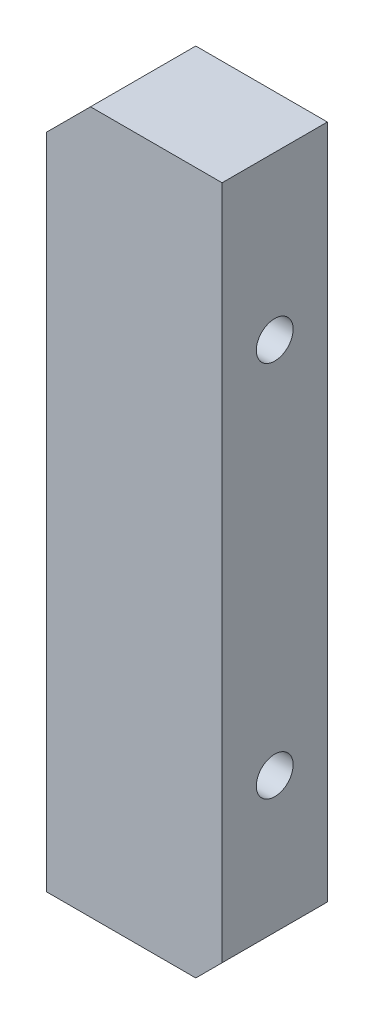
ISO-10303-21;
HEADER;
FILE_DESCRIPTION(('STEP AP214'),'2;1');
FILE_NAME('part.step','',(''),(''),'','','');
FILE_SCHEMA(('AUTOMOTIVE_DESIGN { 1 0 10303 214 1 1 1 1 }'));
ENDSEC;
DATA;
#1=APPLICATION_CONTEXT('core data for automotive mechanical design processes');
#2=APPLICATION_PROTOCOL_DEFINITION('international standard','automotive_design',2000,#1);
#3=PRODUCT_CONTEXT('',#1,'mechanical');
#4=PRODUCT('Part','Part','',(#3));
#5=PRODUCT_RELATED_PRODUCT_CATEGORY('part','',(#4));
#6=PRODUCT_DEFINITION_FORMATION('','',#4);
#7=PRODUCT_DEFINITION_CONTEXT('part definition',#1,'design');
#8=PRODUCT_DEFINITION('design','',#6,#7);
#9=PRODUCT_DEFINITION_SHAPE('','',#8);
#10=(LENGTH_UNIT() NAMED_UNIT(*) SI_UNIT(.MILLI.,.METRE.));
#11=(NAMED_UNIT(*) PLANE_ANGLE_UNIT() SI_UNIT($,.RADIAN.));
#12=(NAMED_UNIT(*) SI_UNIT($,.STERADIAN.) SOLID_ANGLE_UNIT());
#13=UNCERTAINTY_MEASURE_WITH_UNIT(LENGTH_MEASURE(1.E-05),#10,'distance_accuracy_value','');
#14=(GEOMETRIC_REPRESENTATION_CONTEXT(3) GLOBAL_UNCERTAINTY_ASSIGNED_CONTEXT((#13)) GLOBAL_UNIT_ASSIGNED_CONTEXT((#10,
#11,#12)) REPRESENTATION_CONTEXT('',''));
#15=CARTESIAN_POINT('',(0.,0.,0.));
#16=DIRECTION('',(0.,0.,1.));
#17=DIRECTION('',(1.,0.,0.));
#18=AXIS2_PLACEMENT_3D('',#15,#16,#17);
#19=CARTESIAN_POINT('',(0.,0.,12.));
#20=DIRECTION('',(1.,0.,0.));
#21=DIRECTION('',(0.,0.,-1.));
#22=AXIS2_PLACEMENT_3D('',#19,#20,#21);
#23=PLANE('',#22);
#24=DIRECTION('',(0.,-1.,0.));
#25=VECTOR('',#24,1.);
#26=CARTESIAN_POINT('',(0.,0.,0.));
#27=LINE('',#26,#25);
#28=CARTESIAN_POINT('',(0.,75.,0.));
#29=VERTEX_POINT('',#28);
#30=CARTESIAN_POINT('',(0.,0.,0.));
#31=VERTEX_POINT('',#30);
#32=EDGE_CURVE('E132',#29,#31,#27,.T.);
#33=ORIENTED_EDGE('',*,*,#32,.T.);
#34=DIRECTION('',(0.,0.,-1.));
#35=VECTOR('',#34,1.);
#36=CARTESIAN_POINT('',(0.,0.,12.));
#37=LINE('',#36,#35);
#38=CARTESIAN_POINT('',(0.,0.,12.));
#39=VERTEX_POINT('',#38);
#40=EDGE_CURVE('E11',#39,#31,#37,.T.);
#41=ORIENTED_EDGE('',*,*,#40,.F.);
#42=DIRECTION('',(0.,-1.,0.));
#43=VECTOR('',#42,1.);
#44=CARTESIAN_POINT('',(0.,0.,12.));
#45=LINE('',#44,#43);
#46=CARTESIAN_POINT('',(0.,75.,12.));
#47=VERTEX_POINT('',#46);
#48=EDGE_CURVE('E143',#47,#39,#45,.T.);
#49=ORIENTED_EDGE('',*,*,#48,.F.);
#50=DIRECTION('',(0.,0.,-1.));
#51=VECTOR('',#50,1.);
#52=CARTESIAN_POINT('',(0.,75.,12.));
#53=LINE('',#52,#51);
#54=EDGE_CURVE('E128',#47,#29,#53,.T.);
#55=ORIENTED_EDGE('',*,*,#54,.T.);
#56=EDGE_LOOP('',(#33,#41,#49,#55));
#57=FACE_BOUND('',#56,.T.);
#58=ADVANCED_FACE('F45',(#57),#23,.F.);
#59=CARTESIAN_POINT('',(0.,0.,12.));
#60=DIRECTION('',(0.,1.,0.));
#61=DIRECTION('',(0.,0.,1.));
#62=AXIS2_PLACEMENT_3D('',#59,#60,#61);
#63=PLANE('',#62);
#64=CARTESIAN_POINT('',(8.,0.,6.));
#65=DIRECTION('',(0.,-1.,0.));
#66=DIRECTION('',(0.,0.,-1.));
#67=AXIS2_PLACEMENT_3D('',#64,#65,#66);
#68=CIRCLE('',#67,2.09999999999999);
#69=CARTESIAN_POINT('',(8.,0.,3.90000000000001));
#70=VERTEX_POINT('',#69);
#71=EDGE_CURVE('E198',#70,#70,#68,.T.);
#72=ORIENTED_EDGE('',*,*,#71,.F.);
#73=EDGE_LOOP('',(#72));
#74=FACE_BOUND('',#73,.T.);
#75=DIRECTION('',(1.,0.,0.));
#76=VECTOR('',#75,1.);
#77=CARTESIAN_POINT('',(0.,0.,0.));
#78=LINE('',#77,#76);
#79=CARTESIAN_POINT('',(17.,0.,0.));
#80=VERTEX_POINT('',#79);
#81=EDGE_CURVE('E135',#31,#80,#78,.T.);
#82=ORIENTED_EDGE('',*,*,#81,.T.);
#83=DIRECTION('',(0.,0.,-1.));
#84=VECTOR('',#83,1.);
#85=CARTESIAN_POINT('',(17.,0.,12.));
#86=LINE('',#85,#84);
#87=CARTESIAN_POINT('',(17.,0.,12.));
#88=VERTEX_POINT('',#87);
#89=EDGE_CURVE('E53',#88,#80,#86,.T.);
#90=ORIENTED_EDGE('',*,*,#89,.F.);
#91=DIRECTION('',(1.,0.,0.));
#92=VECTOR('',#91,1.);
#93=CARTESIAN_POINT('',(0.,0.,12.));
#94=LINE('',#93,#92);
#95=EDGE_CURVE('E99',#39,#88,#94,.T.);
#96=ORIENTED_EDGE('',*,*,#95,.F.);
#97=ORIENTED_EDGE('',*,*,#40,.T.);
#98=EDGE_LOOP('',(#82,#90,#96,#97));
#99=FACE_BOUND('',#98,.T.);
#100=ADVANCED_FACE('F167',(#74,#99),#63,.F.);
#101=CARTESIAN_POINT('',(17.,0.,12.));
#102=DIRECTION('',(-0.707106781186548,0.707106781186547,0.));
#103=DIRECTION('',(-0.707106781186547,-0.707106781186548,0.));
#104=AXIS2_PLACEMENT_3D('',#101,#102,#103);
#105=PLANE('',#104);
#106=DIRECTION('',(0.707106781186547,0.707106781186548,0.));
#107=VECTOR('',#106,1.);
#108=CARTESIAN_POINT('',(17.,0.,0.));
#109=LINE('',#108,#107);
#110=CARTESIAN_POINT('',(20.,3.,0.));
#111=VERTEX_POINT('',#110);
#112=EDGE_CURVE('E138',#80,#111,#109,.T.);
#113=ORIENTED_EDGE('',*,*,#112,.T.);
#114=DIRECTION('',(0.,0.,-1.));
#115=VECTOR('',#114,1.);
#116=CARTESIAN_POINT('',(20.,3.,12.));
#117=LINE('',#116,#115);
#118=CARTESIAN_POINT('',(20.,3.,12.));
#119=VERTEX_POINT('',#118);
#120=EDGE_CURVE('E123',#119,#111,#117,.T.);
#121=ORIENTED_EDGE('',*,*,#120,.F.);
#122=DIRECTION('',(0.707106781186547,0.707106781186548,0.));
#123=VECTOR('',#122,1.);
#124=CARTESIAN_POINT('',(17.,0.,12.));
#125=LINE('',#124,#123);
#126=EDGE_CURVE('E114',#88,#119,#125,.T.);
#127=ORIENTED_EDGE('',*,*,#126,.F.);
#128=ORIENTED_EDGE('',*,*,#89,.T.);
#129=EDGE_LOOP('',(#113,#121,#127,#128));
#130=FACE_BOUND('',#129,.T.);
#131=ADVANCED_FACE('F149',(#130),#105,.F.);
#132=CARTESIAN_POINT('',(20.,3.,12.));
#133=DIRECTION('',(-1.,0.,0.));
#134=DIRECTION('',(0.,0.,1.));
#135=AXIS2_PLACEMENT_3D('',#132,#133,#134);
#136=PLANE('',#135);
#137=CARTESIAN_POINT('',(20.,18.5,6.));
#138=DIRECTION('',(1.,0.,0.));
#139=DIRECTION('',(0.,0.,-1.));
#140=AXIS2_PLACEMENT_3D('',#137,#138,#139);
#141=CIRCLE('',#140,2.09999999999999);
#142=CARTESIAN_POINT('',(20.,18.5,3.90000000000001));
#143=VERTEX_POINT('',#142);
#144=EDGE_CURVE('E189',#143,#143,#141,.T.);
#145=ORIENTED_EDGE('',*,*,#144,.F.);
#146=EDGE_LOOP('',(#145));
#147=FACE_BOUND('',#146,.T.);
#148=CARTESIAN_POINT('',(20.,61.5,6.));
#149=DIRECTION('',(1.,0.,0.));
#150=DIRECTION('',(0.,0.,-1.));
#151=AXIS2_PLACEMENT_3D('',#148,#149,#150);
#152=CIRCLE('',#151,2.09999999999999);
#153=CARTESIAN_POINT('',(20.,61.5,3.90000000000001));
#154=VERTEX_POINT('',#153);
#155=EDGE_CURVE('E192',#154,#154,#152,.T.);
#156=ORIENTED_EDGE('',*,*,#155,.F.);
#157=EDGE_LOOP('',(#156));
#158=FACE_BOUND('',#157,.T.);
#159=DIRECTION('',(0.,1.,0.));
#160=VECTOR('',#159,1.);
#161=CARTESIAN_POINT('',(20.,3.,0.));
#162=LINE('',#161,#160);
#163=CARTESIAN_POINT('',(20.,80.,0.));
#164=VERTEX_POINT('',#163);
#165=EDGE_CURVE('E122',#111,#164,#162,.T.);
#166=ORIENTED_EDGE('',*,*,#165,.T.);
#167=DIRECTION('',(0.,0.,-1.));
#168=VECTOR('',#167,1.);
#169=CARTESIAN_POINT('',(20.,80.,12.));
#170=LINE('',#169,#168);
#171=CARTESIAN_POINT('',(20.,80.,12.));
#172=VERTEX_POINT('',#171);
#173=EDGE_CURVE('E119',#172,#164,#170,.T.);
#174=ORIENTED_EDGE('',*,*,#173,.F.);
#175=DIRECTION('',(0.,1.,0.));
#176=VECTOR('',#175,1.);
#177=CARTESIAN_POINT('',(20.,3.,12.));
#178=LINE('',#177,#176);
#179=EDGE_CURVE('E108',#119,#172,#178,.T.);
#180=ORIENTED_EDGE('',*,*,#179,.F.);
#181=ORIENTED_EDGE('',*,*,#120,.T.);
#182=EDGE_LOOP('',(#166,#174,#180,#181));
#183=FACE_BOUND('',#182,.T.);
#184=ADVANCED_FACE('F120',(#147,#158,#183),#136,.F.);
#185=CARTESIAN_POINT('',(5.,80.,12.));
#186=DIRECTION('',(0.,-1.,0.));
#187=DIRECTION('',(1.,0.,0.));
#188=AXIS2_PLACEMENT_3D('',#185,#186,#187);
#189=PLANE('',#188);
#190=DIRECTION('',(-1.,0.,0.));
#191=VECTOR('',#190,1.);
#192=CARTESIAN_POINT('',(5.,80.,0.));
#193=LINE('',#192,#191);
#194=CARTESIAN_POINT('',(5.,80.,0.));
#195=VERTEX_POINT('',#194);
#196=EDGE_CURVE('E85',#164,#195,#193,.T.);
#197=ORIENTED_EDGE('',*,*,#196,.T.);
#198=DIRECTION('',(0.,0.,-1.));
#199=VECTOR('',#198,1.);
#200=CARTESIAN_POINT('',(5.,80.,12.));
#201=LINE('',#200,#199);
#202=CARTESIAN_POINT('',(5.,80.,12.));
#203=VERTEX_POINT('',#202);
#204=EDGE_CURVE('E124',#203,#195,#201,.T.);
#205=ORIENTED_EDGE('',*,*,#204,.F.);
#206=DIRECTION('',(-1.,0.,0.));
#207=VECTOR('',#206,1.);
#208=CARTESIAN_POINT('',(5.,80.,12.));
#209=LINE('',#208,#207);
#210=EDGE_CURVE('E112',#172,#203,#209,.T.);
#211=ORIENTED_EDGE('',*,*,#210,.F.);
#212=ORIENTED_EDGE('',*,*,#173,.T.);
#213=EDGE_LOOP('',(#197,#205,#211,#212));
#214=FACE_BOUND('',#213,.T.);
#215=ADVANCED_FACE('F126',(#214),#189,.F.);
#216=CARTESIAN_POINT('',(0.,75.,12.));
#217=DIRECTION('',(0.707106781186548,-0.707106781186547,0.));
#218=DIRECTION('',(0.707106781186547,0.707106781186548,0.));
#219=AXIS2_PLACEMENT_3D('',#216,#217,#218);
#220=PLANE('',#219);
#221=DIRECTION('',(-0.707106781186547,-0.707106781186548,0.));
#222=VECTOR('',#221,1.);
#223=CARTESIAN_POINT('',(0.,75.,0.));
#224=LINE('',#223,#222);
#225=EDGE_CURVE('E91',#195,#29,#224,.T.);
#226=ORIENTED_EDGE('',*,*,#225,.T.);
#227=ORIENTED_EDGE('',*,*,#54,.F.);
#228=DIRECTION('',(-0.707106781186547,-0.707106781186548,0.));
#229=VECTOR('',#228,1.);
#230=CARTESIAN_POINT('',(0.,75.,12.));
#231=LINE('',#230,#229);
#232=EDGE_CURVE('E61',#203,#47,#231,.T.);
#233=ORIENTED_EDGE('',*,*,#232,.F.);
#234=ORIENTED_EDGE('',*,*,#204,.T.);
#235=EDGE_LOOP('',(#226,#227,#233,#234));
#236=FACE_BOUND('',#235,.T.);
#237=ADVANCED_FACE('F156',(#236),#220,.F.);
#238=CARTESIAN_POINT('',(0.,80.,12.));
#239=DIRECTION('',(0.,0.,-1.));
#240=DIRECTION('',(-1.,0.,0.));
#241=AXIS2_PLACEMENT_3D('',#238,#239,#240);
#242=PLANE('',#241);
#243=ORIENTED_EDGE('',*,*,#48,.T.);
#244=ORIENTED_EDGE('',*,*,#95,.T.);
#245=ORIENTED_EDGE('',*,*,#126,.T.);
#246=ORIENTED_EDGE('',*,*,#179,.T.);
#247=ORIENTED_EDGE('',*,*,#210,.T.);
#248=ORIENTED_EDGE('',*,*,#232,.T.);
#249=EDGE_LOOP('',(#243,#244,#245,#246,#247,#248));
#250=FACE_BOUND('',#249,.T.);
#251=ADVANCED_FACE('F110',(#250),#242,.F.);
#252=CARTESIAN_POINT('',(0.,80.,0.));
#253=DIRECTION('',(0.,0.,-1.));
#254=DIRECTION('',(-1.,0.,0.));
#255=AXIS2_PLACEMENT_3D('',#252,#253,#254);
#256=PLANE('',#255);
#257=ORIENTED_EDGE('',*,*,#32,.F.);
#258=ORIENTED_EDGE('',*,*,#225,.F.);
#259=ORIENTED_EDGE('',*,*,#196,.F.);
#260=ORIENTED_EDGE('',*,*,#165,.F.);
#261=ORIENTED_EDGE('',*,*,#112,.F.);
#262=ORIENTED_EDGE('',*,*,#81,.F.);
#263=EDGE_LOOP('',(#257,#258,#259,#260,#261,#262));
#264=FACE_BOUND('',#263,.T.);
#265=ADVANCED_FACE('F152',(#264),#256,.T.);
#266=CARTESIAN_POINT('',(8.,14.,6.));
#267=DIRECTION('',(0.,-1.,0.));
#268=DIRECTION('',(0.,0.,-1.));
#269=AXIS2_PLACEMENT_3D('',#266,#267,#268);
#270=CONICAL_SURFACE('',#269,2.09999999999999,1.02974425867665);
#271=CARTESIAN_POINT('',(8.,15.2618072999579,6.));
#272=VERTEX_POINT('',#271);
#273=VERTEX_LOOP('',#272);
#274=FACE_BOUND('',#273,.T.);
#275=CARTESIAN_POINT('',(8.,14.,6.));
#276=DIRECTION('',(0.,-1.,0.));
#277=DIRECTION('',(0.,0.,-1.));
#278=AXIS2_PLACEMENT_3D('',#275,#276,#277);
#279=CIRCLE('',#278,2.09999999999999);
#280=CARTESIAN_POINT('',(8.,14.,3.90000000000001));
#281=VERTEX_POINT('',#280);
#282=EDGE_CURVE('E136',#281,#281,#279,.T.);
#283=ORIENTED_EDGE('',*,*,#282,.T.);
#284=EDGE_LOOP('',(#283));
#285=FACE_BOUND('',#284,.T.);
#286=ADVANCED_FACE('F211',(#274,#285),#270,.F.);
#287=CARTESIAN_POINT('',(8.,0.,6.));
#288=DIRECTION('',(0.,-1.,0.));
#289=DIRECTION('',(0.,0.,-1.));
#290=AXIS2_PLACEMENT_3D('',#287,#288,#289);
#291=CYLINDRICAL_SURFACE('',#290,2.09999999999999);
#292=ORIENTED_EDGE('',*,*,#282,.F.);
#293=EDGE_LOOP('',(#292));
#294=FACE_BOUND('',#293,.T.);
#295=ORIENTED_EDGE('',*,*,#71,.T.);
#296=EDGE_LOOP('',(#295));
#297=FACE_BOUND('',#296,.T.);
#298=ADVANCED_FACE('F213',(#294,#297),#291,.F.);
#299=CARTESIAN_POINT('',(6.,61.5,6.));
#300=DIRECTION('',(1.,0.,0.));
#301=DIRECTION('',(0.,0.,-1.));
#302=AXIS2_PLACEMENT_3D('',#299,#300,#301);
#303=CONICAL_SURFACE('',#302,2.09999999999999,1.02974425867666);
#304=CARTESIAN_POINT('',(4.73819270004213,61.5,6.));
#305=VERTEX_POINT('',#304);
#306=VERTEX_LOOP('',#305);
#307=FACE_BOUND('',#306,.T.);
#308=CARTESIAN_POINT('',(6.,61.5,6.));
#309=DIRECTION('',(1.,0.,0.));
#310=DIRECTION('',(0.,0.,-1.));
#311=AXIS2_PLACEMENT_3D('',#308,#309,#310);
#312=CIRCLE('',#311,2.09999999999999);
#313=CARTESIAN_POINT('',(6.,61.5,3.90000000000001));
#314=VERTEX_POINT('',#313);
#315=EDGE_CURVE('E194',#314,#314,#312,.T.);
#316=ORIENTED_EDGE('',*,*,#315,.T.);
#317=EDGE_LOOP('',(#316));
#318=FACE_BOUND('',#317,.T.);
#319=ADVANCED_FACE('F216',(#307,#318),#303,.F.);
#320=CARTESIAN_POINT('',(20.,61.5,6.));
#321=DIRECTION('',(1.,0.,0.));
#322=DIRECTION('',(0.,0.,-1.));
#323=AXIS2_PLACEMENT_3D('',#320,#321,#322);
#324=CYLINDRICAL_SURFACE('',#323,2.09999999999999);
#325=ORIENTED_EDGE('',*,*,#315,.F.);
#326=EDGE_LOOP('',(#325));
#327=FACE_BOUND('',#326,.T.);
#328=ORIENTED_EDGE('',*,*,#155,.T.);
#329=EDGE_LOOP('',(#328));
#330=FACE_BOUND('',#329,.T.);
#331=ADVANCED_FACE('F221',(#327,#330),#324,.F.);
#332=CARTESIAN_POINT('',(6.,18.5,6.));
#333=DIRECTION('',(1.,0.,0.));
#334=DIRECTION('',(0.,0.,-1.));
#335=AXIS2_PLACEMENT_3D('',#332,#333,#334);
#336=CONICAL_SURFACE('',#335,2.09999999999999,1.02974425867665);
#337=CARTESIAN_POINT('',(4.73819270004213,18.5,6.));
#338=VERTEX_POINT('',#337);
#339=VERTEX_LOOP('',#338);
#340=FACE_BOUND('',#339,.T.);
#341=CARTESIAN_POINT('',(6.,18.5,6.));
#342=DIRECTION('',(1.,0.,0.));
#343=DIRECTION('',(0.,0.,-1.));
#344=AXIS2_PLACEMENT_3D('',#341,#342,#343);
#345=CIRCLE('',#344,2.09999999999999);
#346=CARTESIAN_POINT('',(6.,18.5,3.90000000000001));
#347=VERTEX_POINT('',#346);
#348=EDGE_CURVE('E195',#347,#347,#345,.T.);
#349=ORIENTED_EDGE('',*,*,#348,.T.);
#350=EDGE_LOOP('',(#349));
#351=FACE_BOUND('',#350,.T.);
#352=ADVANCED_FACE('F269',(#340,#351),#336,.F.);
#353=CARTESIAN_POINT('',(20.,18.5,6.));
#354=DIRECTION('',(1.,0.,0.));
#355=DIRECTION('',(0.,0.,-1.));
#356=AXIS2_PLACEMENT_3D('',#353,#354,#355);
#357=CYLINDRICAL_SURFACE('',#356,2.09999999999999);
#358=ORIENTED_EDGE('',*,*,#348,.F.);
#359=EDGE_LOOP('',(#358));
#360=FACE_BOUND('',#359,.T.);
#361=ORIENTED_EDGE('',*,*,#144,.T.);
#362=EDGE_LOOP('',(#361));
#363=FACE_BOUND('',#362,.T.);
#364=ADVANCED_FACE('F277',(#360,#363),#357,.F.);
#365=CLOSED_SHELL('',(#58,#100,#131,#184,#215,#237,#251,#265,#286,#298,#319,#331,#352,#364));
#366=MANIFOLD_SOLID_BREP('B2',#365);
#367=ADVANCED_BREP_SHAPE_REPRESENTATION('',(#18,#366),#14);
#368=SHAPE_DEFINITION_REPRESENTATION(#9,#367);
ENDSEC;
END-ISO-10303-21;
